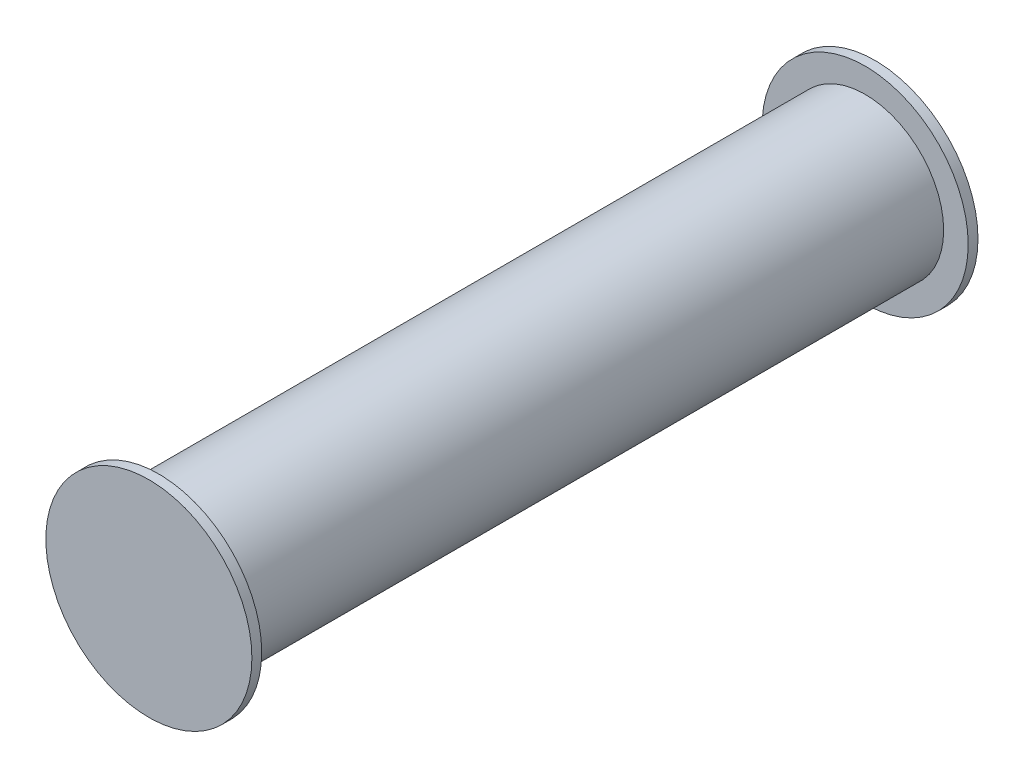
ISO-10303-21;
HEADER;
FILE_DESCRIPTION(('STEP AP214'),'2;1');
FILE_NAME('part.step','',(''),(''),'','','');
FILE_SCHEMA(('AUTOMOTIVE_DESIGN { 1 0 10303 214 1 1 1 1 }'));
ENDSEC;
DATA;
#1=APPLICATION_CONTEXT('core data for automotive mechanical design processes');
#2=APPLICATION_PROTOCOL_DEFINITION('international standard','automotive_design',2000,#1);
#3=PRODUCT_CONTEXT('',#1,'mechanical');
#4=PRODUCT('Part','Part','',(#3));
#5=PRODUCT_RELATED_PRODUCT_CATEGORY('part','',(#4));
#6=PRODUCT_DEFINITION_FORMATION('','',#4);
#7=PRODUCT_DEFINITION_CONTEXT('part definition',#1,'design');
#8=PRODUCT_DEFINITION('design','',#6,#7);
#9=PRODUCT_DEFINITION_SHAPE('','',#8);
#10=(LENGTH_UNIT() NAMED_UNIT(*) SI_UNIT(.MILLI.,.METRE.));
#11=(NAMED_UNIT(*) PLANE_ANGLE_UNIT() SI_UNIT($,.RADIAN.));
#12=(NAMED_UNIT(*) SI_UNIT($,.STERADIAN.) SOLID_ANGLE_UNIT());
#13=UNCERTAINTY_MEASURE_WITH_UNIT(LENGTH_MEASURE(1.E-05),#10,'distance_accuracy_value','');
#14=(GEOMETRIC_REPRESENTATION_CONTEXT(3) GLOBAL_UNCERTAINTY_ASSIGNED_CONTEXT((#13)) GLOBAL_UNIT_ASSIGNED_CONTEXT((#10,
#11,#12)) REPRESENTATION_CONTEXT('',''));
#15=CARTESIAN_POINT('',(0.,0.,0.));
#16=DIRECTION('',(0.,0.,1.));
#17=DIRECTION('',(1.,0.,0.));
#18=AXIS2_PLACEMENT_3D('',#15,#16,#17);
#19=CARTESIAN_POINT('',(0.,0.,457.2));
#20=DIRECTION('',(0.,0.,-1.));
#21=DIRECTION('',(-1.,0.,0.));
#22=AXIS2_PLACEMENT_3D('',#19,#20,#21);
#23=CYLINDRICAL_SURFACE('',#22,50.8);
#24=CARTESIAN_POINT('',(0.,0.,457.2));
#25=DIRECTION('',(0.,0.,1.));
#26=DIRECTION('',(1.,0.,0.));
#27=AXIS2_PLACEMENT_3D('',#24,#25,#26);
#28=CIRCLE('',#27,50.8);
#29=CARTESIAN_POINT('',(50.8,0.,457.2));
#30=VERTEX_POINT('',#29);
#31=EDGE_CURVE('E11',#30,#30,#28,.T.);
#32=ORIENTED_EDGE('',*,*,#31,.F.);
#33=EDGE_LOOP('',(#32));
#34=FACE_BOUND('',#33,.T.);
#35=CARTESIAN_POINT('',(0.,0.,0.));
#36=DIRECTION('',(0.,0.,1.));
#37=DIRECTION('',(1.,0.,0.));
#38=AXIS2_PLACEMENT_3D('',#35,#36,#37);
#39=CIRCLE('',#38,50.8);
#40=CARTESIAN_POINT('',(50.8,0.,0.));
#41=VERTEX_POINT('',#40);
#42=EDGE_CURVE('E39',#41,#41,#39,.T.);
#43=ORIENTED_EDGE('',*,*,#42,.T.);
#44=EDGE_LOOP('',(#43));
#45=FACE_BOUND('',#44,.T.);
#46=ADVANCED_FACE('F36',(#34,#45),#23,.T.);
#47=CARTESIAN_POINT('',(0.,0.,457.2));
#48=DIRECTION('',(0.,0.,1.));
#49=DIRECTION('',(1.,0.,0.));
#50=AXIS2_PLACEMENT_3D('',#47,#48,#49);
#51=PLANE('',#50);
#52=ORIENTED_EDGE('',*,*,#31,.T.);
#53=EDGE_LOOP('',(#52));
#54=FACE_BOUND('',#53,.T.);
#55=CARTESIAN_POINT('',(0.,0.,457.2));
#56=DIRECTION('',(0.,0.,1.));
#57=DIRECTION('',(1.,0.,0.));
#58=AXIS2_PLACEMENT_3D('',#55,#56,#57);
#59=CIRCLE('',#58,66.675);
#60=CARTESIAN_POINT('',(66.675,0.,457.2));
#61=VERTEX_POINT('',#60);
#62=EDGE_CURVE('E54',#61,#61,#59,.T.);
#63=ORIENTED_EDGE('',*,*,#62,.F.);
#64=EDGE_LOOP('',(#63));
#65=FACE_BOUND('',#64,.T.);
#66=ADVANCED_FACE('F90',(#54,#65),#51,.F.);
#67=CARTESIAN_POINT('',(0.,0.,463.55));
#68=DIRECTION('',(0.,0.,1.));
#69=DIRECTION('',(1.,0.,0.));
#70=AXIS2_PLACEMENT_3D('',#67,#68,#69);
#71=PLANE('',#70);
#72=CARTESIAN_POINT('',(0.,0.,463.55));
#73=DIRECTION('',(0.,0.,1.));
#74=DIRECTION('',(1.,0.,0.));
#75=AXIS2_PLACEMENT_3D('',#72,#73,#74);
#76=CIRCLE('',#75,66.675);
#77=CARTESIAN_POINT('',(66.675,0.,463.55));
#78=VERTEX_POINT('',#77);
#79=EDGE_CURVE('E52',#78,#78,#76,.T.);
#80=ORIENTED_EDGE('',*,*,#79,.T.);
#81=EDGE_LOOP('',(#80));
#82=FACE_BOUND('',#81,.T.);
#83=ADVANCED_FACE('F95',(#82),#71,.T.);
#84=CARTESIAN_POINT('',(0.,0.,463.55));
#85=DIRECTION('',(0.,0.,-1.));
#86=DIRECTION('',(-1.,0.,0.));
#87=AXIS2_PLACEMENT_3D('',#84,#85,#86);
#88=CYLINDRICAL_SURFACE('',#87,66.675);
#89=ORIENTED_EDGE('',*,*,#79,.F.);
#90=EDGE_LOOP('',(#89));
#91=FACE_BOUND('',#90,.T.);
#92=ORIENTED_EDGE('',*,*,#62,.T.);
#93=EDGE_LOOP('',(#92));
#94=FACE_BOUND('',#93,.T.);
#95=ADVANCED_FACE('F74',(#91,#94),#88,.T.);
#96=CARTESIAN_POINT('',(0.,0.,0.));
#97=DIRECTION('',(0.,0.,-1.));
#98=DIRECTION('',(1.,0.,0.));
#99=AXIS2_PLACEMENT_3D('',#96,#97,#98);
#100=PLANE('',#99);
#101=ORIENTED_EDGE('',*,*,#42,.F.);
#102=EDGE_LOOP('',(#101));
#103=FACE_BOUND('',#102,.T.);
#104=CARTESIAN_POINT('',(0.,0.,0.));
#105=DIRECTION('',(0.,0.,1.));
#106=DIRECTION('',(1.,0.,0.));
#107=AXIS2_PLACEMENT_3D('',#104,#105,#106);
#108=CIRCLE('',#107,66.675);
#109=CARTESIAN_POINT('',(66.675,0.,0.));
#110=VERTEX_POINT('',#109);
#111=EDGE_CURVE('E59',#110,#110,#108,.T.);
#112=ORIENTED_EDGE('',*,*,#111,.T.);
#113=EDGE_LOOP('',(#112));
#114=FACE_BOUND('',#113,.T.);
#115=ADVANCED_FACE('F70',(#103,#114),#100,.F.);
#116=CARTESIAN_POINT('',(0.,0.,-6.35));
#117=DIRECTION('',(0.,0.,-1.));
#118=DIRECTION('',(1.,0.,0.));
#119=AXIS2_PLACEMENT_3D('',#116,#117,#118);
#120=PLANE('',#119);
#121=CARTESIAN_POINT('',(0.,0.,-6.35));
#122=DIRECTION('',(0.,0.,1.));
#123=DIRECTION('',(1.,0.,0.));
#124=AXIS2_PLACEMENT_3D('',#121,#122,#123);
#125=CIRCLE('',#124,66.675);
#126=CARTESIAN_POINT('',(66.675,0.,-6.35));
#127=VERTEX_POINT('',#126);
#128=EDGE_CURVE('E62',#127,#127,#125,.T.);
#129=ORIENTED_EDGE('',*,*,#128,.F.);
#130=EDGE_LOOP('',(#129));
#131=FACE_BOUND('',#130,.T.);
#132=ADVANCED_FACE('F73',(#131),#120,.T.);
#133=CARTESIAN_POINT('',(0.,0.,-6.35));
#134=DIRECTION('',(0.,0.,1.));
#135=DIRECTION('',(1.,0.,0.));
#136=AXIS2_PLACEMENT_3D('',#133,#134,#135);
#137=CYLINDRICAL_SURFACE('',#136,66.675);
#138=ORIENTED_EDGE('',*,*,#128,.T.);
#139=EDGE_LOOP('',(#138));
#140=FACE_BOUND('',#139,.T.);
#141=ORIENTED_EDGE('',*,*,#111,.F.);
#142=EDGE_LOOP('',(#141));
#143=FACE_BOUND('',#142,.T.);
#144=ADVANCED_FACE('F79',(#140,#143),#137,.T.);
#145=CLOSED_SHELL('',(#46,#66,#83,#95,#115,#132,#144));
#146=CARTESIAN_POINT('',(0.,0.,0.));
#147=DIRECTION('',(0.,0.,1.));
#148=DIRECTION('',(1.,0.,0.));
#149=AXIS2_PLACEMENT_3D('',#146,#147,#148);
#150=CIRCLE('',#149,41.275);
#151=CARTESIAN_POINT('',(41.275,0.,0.));
#152=VERTEX_POINT('',#151);
#153=EDGE_CURVE('E44',#152,#152,#150,.T.);
#154=ORIENTED_EDGE('',*,*,#153,.T.);
#155=EDGE_LOOP('',(#154));
#156=FACE_BOUND('',#155,.T.);
#157=ADVANCED_FACE('F76',(#156),#100,.F.);
#158=CARTESIAN_POINT('',(0.,0.,457.2));
#159=DIRECTION('',(0.,0.,1.));
#160=DIRECTION('',(1.,0.,0.));
#161=AXIS2_PLACEMENT_3D('',#158,#159,#160);
#162=CIRCLE('',#161,41.275);
#163=CARTESIAN_POINT('',(41.275,0.,457.2));
#164=VERTEX_POINT('',#163);
#165=EDGE_CURVE('E48',#164,#164,#162,.T.);
#166=ORIENTED_EDGE('',*,*,#165,.F.);
#167=EDGE_LOOP('',(#166));
#168=FACE_BOUND('',#167,.T.);
#169=ADVANCED_FACE('F97',(#168),#51,.F.);
#170=CARTESIAN_POINT('',(0.,0.,0.));
#171=DIRECTION('',(0.,0.,1.));
#172=DIRECTION('',(1.,0.,0.));
#173=AXIS2_PLACEMENT_3D('',#170,#171,#172);
#174=CYLINDRICAL_SURFACE('',#173,41.275);
#175=ORIENTED_EDGE('',*,*,#153,.F.);
#176=EDGE_LOOP('',(#175));
#177=FACE_BOUND('',#176,.T.);
#178=ORIENTED_EDGE('',*,*,#165,.T.);
#179=EDGE_LOOP('',(#178));
#180=FACE_BOUND('',#179,.T.);
#181=ADVANCED_FACE('F105',(#177,#180),#174,.F.);
#182=CLOSED_SHELL('',(#157,#169,#181));
#183=ORIENTED_CLOSED_SHELL('',*,#182,.T.);
#184=BREP_WITH_VOIDS('B2',#145,(#183));
#185=ADVANCED_BREP_SHAPE_REPRESENTATION('',(#18,#184),#14);
#186=SHAPE_DEFINITION_REPRESENTATION(#9,#185);
ENDSEC;
END-ISO-10303-21;
